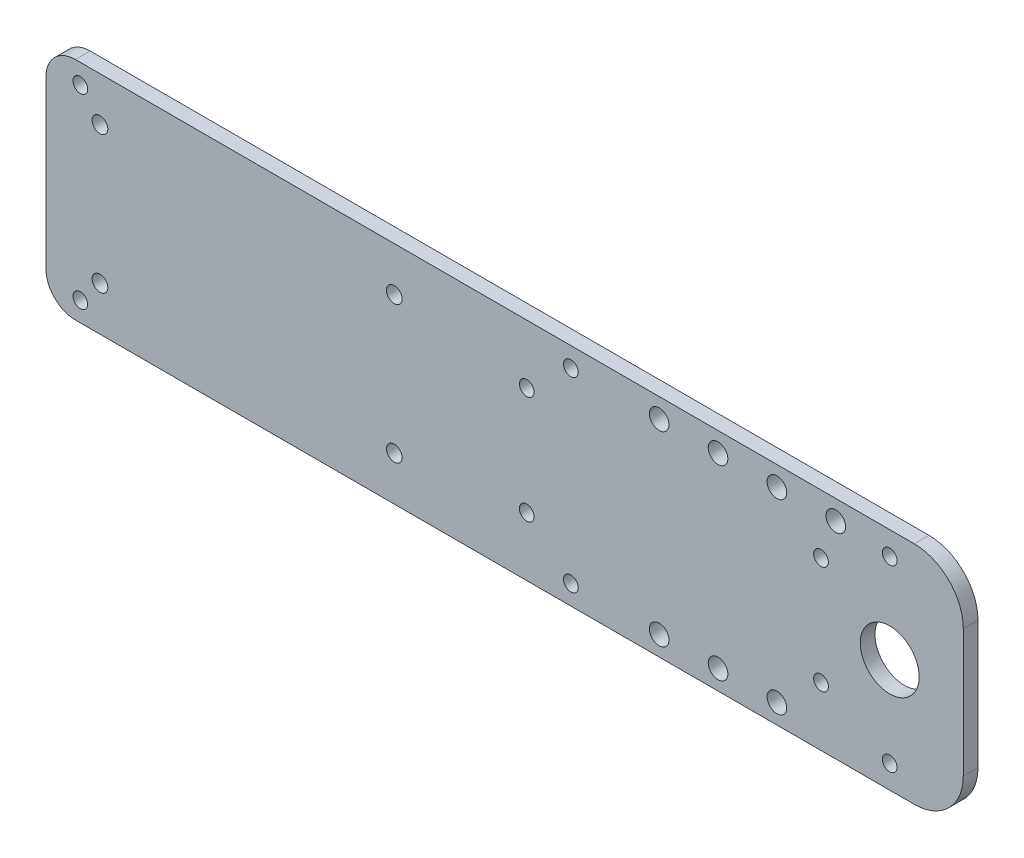
ISO-10303-21;
HEADER;
FILE_DESCRIPTION(('STEP AP214'),'2;1');
FILE_NAME('part.step','',(''),(''),'','','');
FILE_SCHEMA(('AUTOMOTIVE_DESIGN { 1 0 10303 214 1 1 1 1 }'));
ENDSEC;
DATA;
#1=APPLICATION_CONTEXT('core data for automotive mechanical design processes');
#2=APPLICATION_PROTOCOL_DEFINITION('international standard','automotive_design',2000,#1);
#3=PRODUCT_CONTEXT('',#1,'mechanical');
#4=PRODUCT('Part','Part','',(#3));
#5=PRODUCT_RELATED_PRODUCT_CATEGORY('part','',(#4));
#6=PRODUCT_DEFINITION_FORMATION('','',#4);
#7=PRODUCT_DEFINITION_CONTEXT('part definition',#1,'design');
#8=PRODUCT_DEFINITION('design','',#6,#7);
#9=PRODUCT_DEFINITION_SHAPE('','',#8);
#10=(LENGTH_UNIT() NAMED_UNIT(*) SI_UNIT(.MILLI.,.METRE.));
#11=(NAMED_UNIT(*) PLANE_ANGLE_UNIT() SI_UNIT($,.RADIAN.));
#12=(NAMED_UNIT(*) SI_UNIT($,.STERADIAN.) SOLID_ANGLE_UNIT());
#13=UNCERTAINTY_MEASURE_WITH_UNIT(LENGTH_MEASURE(1.E-05),#10,'distance_accuracy_value','');
#14=(GEOMETRIC_REPRESENTATION_CONTEXT(3) GLOBAL_UNCERTAINTY_ASSIGNED_CONTEXT((#13)) GLOBAL_UNIT_ASSIGNED_CONTEXT((#10,
#11,#12)) REPRESENTATION_CONTEXT('',''));
#15=CARTESIAN_POINT('',(0.,0.,0.));
#16=DIRECTION('',(0.,0.,1.));
#17=DIRECTION('',(1.,0.,0.));
#18=AXIS2_PLACEMENT_3D('',#15,#16,#17);
#19=CARTESIAN_POINT('',(0.,0.,3.));
#20=DIRECTION('',(0.,0.,1.));
#21=DIRECTION('',(1.,0.,0.));
#22=AXIS2_PLACEMENT_3D('',#19,#20,#21);
#23=PLANE('',#22);
#24=CARTESIAN_POINT('',(102.,11.,3.));
#25=DIRECTION('',(0.,0.,1.));
#26=DIRECTION('',(1.,0.,0.));
#27=AXIS2_PLACEMENT_3D('',#24,#25,#26);
#28=CIRCLE('',#27,1.5);
#29=CARTESIAN_POINT('',(103.5,11.,3.));
#30=VERTEX_POINT('',#29);
#31=EDGE_CURVE('E330',#30,#30,#28,.F.);
#32=ORIENTED_EDGE('',*,*,#31,.T.);
#33=EDGE_LOOP('',(#32));
#34=FACE_BOUND('',#33,.T.);
#35=CARTESIAN_POINT('',(69.,19.,3.));
#36=DIRECTION('',(0.,0.,1.));
#37=DIRECTION('',(1.,0.,0.));
#38=AXIS2_PLACEMENT_3D('',#35,#36,#37);
#39=CIRCLE('',#38,2.);
#40=CARTESIAN_POINT('',(71.,19.,3.));
#41=VERTEX_POINT('',#40);
#42=EDGE_CURVE('E342',#41,#41,#39,.T.);
#43=ORIENTED_EDGE('',*,*,#42,.F.);
#44=EDGE_LOOP('',(#43));
#45=FACE_BOUND('',#44,.T.);
#46=CARTESIAN_POINT('',(-49.,-19.,3.));
#47=DIRECTION('',(0.,0.,1.));
#48=DIRECTION('',(1.,0.,0.));
#49=AXIS2_PLACEMENT_3D('',#46,#47,#48);
#50=CIRCLE('',#49,1.5);
#51=CARTESIAN_POINT('',(-47.5,-19.,3.));
#52=VERTEX_POINT('',#51);
#53=EDGE_CURVE('E367',#52,#52,#50,.F.);
#54=ORIENTED_EDGE('',*,*,#53,.T.);
#55=EDGE_LOOP('',(#54));
#56=FACE_BOUND('',#55,.T.);
#57=CARTESIAN_POINT('',(69.,-19.,3.));
#58=DIRECTION('',(0.,0.,1.));
#59=DIRECTION('',(1.,0.,0.));
#60=AXIS2_PLACEMENT_3D('',#57,#58,#59);
#61=CIRCLE('',#60,2.);
#62=CARTESIAN_POINT('',(71.,-19.,3.));
#63=VERTEX_POINT('',#62);
#64=EDGE_CURVE('E343',#63,#63,#61,.T.);
#65=ORIENTED_EDGE('',*,*,#64,.F.);
#66=EDGE_LOOP('',(#65));
#67=FACE_BOUND('',#66,.T.);
#68=CARTESIAN_POINT('',(81.,-19.,3.));
#69=DIRECTION('',(0.,0.,1.));
#70=DIRECTION('',(1.,0.,0.));
#71=AXIS2_PLACEMENT_3D('',#68,#69,#70);
#72=CIRCLE('',#71,2.);
#73=CARTESIAN_POINT('',(83.,-19.,3.));
#74=VERTEX_POINT('',#73);
#75=EDGE_CURVE('E349',#74,#74,#72,.T.);
#76=ORIENTED_EDGE('',*,*,#75,.F.);
#77=EDGE_LOOP('',(#76));
#78=FACE_BOUND('',#77,.T.);
#79=CARTESIAN_POINT('',(81.,19.,3.));
#80=DIRECTION('',(0.,0.,1.));
#81=DIRECTION('',(1.,0.,0.));
#82=AXIS2_PLACEMENT_3D('',#79,#80,#81);
#83=CIRCLE('',#82,2.);
#84=CARTESIAN_POINT('',(83.,19.,3.));
#85=VERTEX_POINT('',#84);
#86=EDGE_CURVE('E329',#85,#85,#83,.T.);
#87=ORIENTED_EDGE('',*,*,#86,.F.);
#88=EDGE_LOOP('',(#87));
#89=FACE_BOUND('',#88,.T.);
#90=CARTESIAN_POINT('',(-49.,19.,3.));
#91=DIRECTION('',(0.,0.,1.));
#92=DIRECTION('',(1.,0.,0.));
#93=AXIS2_PLACEMENT_3D('',#90,#91,#92);
#94=CIRCLE('',#93,1.5);
#95=CARTESIAN_POINT('',(-47.5,19.,3.));
#96=VERTEX_POINT('',#95);
#97=EDGE_CURVE('E366',#96,#96,#94,.T.);
#98=ORIENTED_EDGE('',*,*,#97,.F.);
#99=EDGE_LOOP('',(#98));
#100=FACE_BOUND('',#99,.T.);
#101=DIRECTION('',(-1.,0.,0.));
#102=VECTOR('',#101,1.);
#103=CARTESIAN_POINT('',(0.,-23.,3.));
#104=LINE('',#103,#102);
#105=CARTESIAN_POINT('',(121.,-23.,3.));
#106=VERTEX_POINT('',#105);
#107=CARTESIAN_POINT('',(-50.,-23.,3.));
#108=VERTEX_POINT('',#107);
#109=EDGE_CURVE('E136',#106,#108,#104,.T.);
#110=ORIENTED_EDGE('',*,*,#109,.F.);
#111=CARTESIAN_POINT('',(121.,-13.,3.));
#112=DIRECTION('',(0.,0.,1.));
#113=DIRECTION('',(1.,0.,0.));
#114=AXIS2_PLACEMENT_3D('',#111,#112,#113);
#115=CIRCLE('',#114,10.);
#116=CARTESIAN_POINT('',(131.,-13.,3.));
#117=VERTEX_POINT('',#116);
#118=EDGE_CURVE('E163',#106,#117,#115,.T.);
#119=ORIENTED_EDGE('',*,*,#118,.T.);
#120=DIRECTION('',(0.,1.,0.));
#121=VECTOR('',#120,1.);
#122=CARTESIAN_POINT('',(131.,0.,3.));
#123=LINE('',#122,#121);
#124=CARTESIAN_POINT('',(131.,13.,3.));
#125=VERTEX_POINT('',#124);
#126=EDGE_CURVE('E177',#117,#125,#123,.T.);
#127=ORIENTED_EDGE('',*,*,#126,.T.);
#128=CARTESIAN_POINT('',(121.,13.,3.));
#129=DIRECTION('',(0.,0.,1.));
#130=DIRECTION('',(1.,0.,0.));
#131=AXIS2_PLACEMENT_3D('',#128,#129,#130);
#132=CIRCLE('',#131,10.);
#133=CARTESIAN_POINT('',(121.,23.,3.));
#134=VERTEX_POINT('',#133);
#135=EDGE_CURVE('E161',#125,#134,#132,.T.);
#136=ORIENTED_EDGE('',*,*,#135,.T.);
#137=DIRECTION('',(-1.,0.,0.));
#138=VECTOR('',#137,1.);
#139=CARTESIAN_POINT('',(0.,23.,3.));
#140=LINE('',#139,#138);
#141=CARTESIAN_POINT('',(-50.,23.,3.));
#142=VERTEX_POINT('',#141);
#143=EDGE_CURVE('E186',#134,#142,#140,.T.);
#144=ORIENTED_EDGE('',*,*,#143,.T.);
#145=CARTESIAN_POINT('',(-50.,17.,3.));
#146=DIRECTION('',(0.,0.,1.));
#147=DIRECTION('',(1.,0.,0.));
#148=AXIS2_PLACEMENT_3D('',#145,#146,#147);
#149=CIRCLE('',#148,6.);
#150=CARTESIAN_POINT('',(-56.,17.,3.));
#151=VERTEX_POINT('',#150);
#152=EDGE_CURVE('E152',#142,#151,#149,.T.);
#153=ORIENTED_EDGE('',*,*,#152,.T.);
#154=DIRECTION('',(0.,1.,0.));
#155=VECTOR('',#154,1.);
#156=CARTESIAN_POINT('',(-56.,0.,3.));
#157=LINE('',#156,#155);
#158=CARTESIAN_POINT('',(-56.,-17.,3.));
#159=VERTEX_POINT('',#158);
#160=EDGE_CURVE('E188',#159,#151,#157,.T.);
#161=ORIENTED_EDGE('',*,*,#160,.F.);
#162=CARTESIAN_POINT('',(-50.,-17.,3.));
#163=DIRECTION('',(0.,0.,1.));
#164=DIRECTION('',(1.,0.,0.));
#165=AXIS2_PLACEMENT_3D('',#162,#163,#164);
#166=CIRCLE('',#165,6.);
#167=EDGE_CURVE('E154',#159,#108,#166,.T.);
#168=ORIENTED_EDGE('',*,*,#167,.T.);
#169=EDGE_LOOP('',(#110,#119,#127,#136,#144,#153,#161,#168));
#170=FACE_BOUND('',#169,.T.);
#171=CARTESIAN_POINT('',(42.,11.,3.));
#172=DIRECTION('',(0.,0.,1.));
#173=DIRECTION('',(1.,0.,0.));
#174=AXIS2_PLACEMENT_3D('',#171,#172,#173);
#175=CIRCLE('',#174,1.50000000000001);
#176=CARTESIAN_POINT('',(43.5,11.,3.));
#177=VERTEX_POINT('',#176);
#178=EDGE_CURVE('E197',#177,#177,#175,.F.);
#179=ORIENTED_EDGE('',*,*,#178,.T.);
#180=EDGE_LOOP('',(#179));
#181=FACE_BOUND('',#180,.T.);
#182=CARTESIAN_POINT('',(15.,-14.,3.));
#183=DIRECTION('',(0.,0.,1.));
#184=DIRECTION('',(1.,0.,0.));
#185=AXIS2_PLACEMENT_3D('',#182,#183,#184);
#186=CIRCLE('',#185,1.6);
#187=CARTESIAN_POINT('',(16.6,-14.,3.));
#188=VERTEX_POINT('',#187);
#189=EDGE_CURVE('E200',#188,#188,#186,.T.);
#190=ORIENTED_EDGE('',*,*,#189,.F.);
#191=EDGE_LOOP('',(#190));
#192=FACE_BOUND('',#191,.T.);
#193=CARTESIAN_POINT('',(42.,-11.,3.));
#194=DIRECTION('',(0.,0.,1.));
#195=DIRECTION('',(1.,0.,0.));
#196=AXIS2_PLACEMENT_3D('',#193,#194,#195);
#197=CIRCLE('',#196,1.49999999999999);
#198=CARTESIAN_POINT('',(43.5,-11.,3.));
#199=VERTEX_POINT('',#198);
#200=EDGE_CURVE('E203',#199,#199,#197,.T.);
#201=ORIENTED_EDGE('',*,*,#200,.F.);
#202=EDGE_LOOP('',(#201));
#203=FACE_BOUND('',#202,.T.);
#204=CARTESIAN_POINT('',(-45.,14.,3.));
#205=DIRECTION('',(0.,0.,1.));
#206=DIRECTION('',(1.,0.,0.));
#207=AXIS2_PLACEMENT_3D('',#204,#205,#206);
#208=CIRCLE('',#207,1.6);
#209=CARTESIAN_POINT('',(-43.4,14.,3.));
#210=VERTEX_POINT('',#209);
#211=EDGE_CURVE('E206',#210,#210,#208,.T.);
#212=ORIENTED_EDGE('',*,*,#211,.F.);
#213=EDGE_LOOP('',(#212));
#214=FACE_BOUND('',#213,.T.);
#215=CARTESIAN_POINT('',(-45.,-14.,3.));
#216=DIRECTION('',(0.,0.,1.));
#217=DIRECTION('',(1.,0.,0.));
#218=AXIS2_PLACEMENT_3D('',#215,#216,#217);
#219=CIRCLE('',#218,1.6);
#220=CARTESIAN_POINT('',(-43.4,-14.,3.));
#221=VERTEX_POINT('',#220);
#222=EDGE_CURVE('E143',#221,#221,#219,.F.);
#223=ORIENTED_EDGE('',*,*,#222,.T.);
#224=EDGE_LOOP('',(#223));
#225=FACE_BOUND('',#224,.T.);
#226=CARTESIAN_POINT('',(15.,14.,3.));
#227=DIRECTION('',(0.,0.,1.));
#228=DIRECTION('',(1.,0.,0.));
#229=AXIS2_PLACEMENT_3D('',#226,#227,#228);
#230=CIRCLE('',#229,1.6);
#231=CARTESIAN_POINT('',(16.6,14.,3.));
#232=VERTEX_POINT('',#231);
#233=EDGE_CURVE('E138',#232,#232,#230,.F.);
#234=ORIENTED_EDGE('',*,*,#233,.T.);
#235=EDGE_LOOP('',(#234));
#236=FACE_BOUND('',#235,.T.);
#237=CARTESIAN_POINT('',(116.,-18.25,3.));
#238=DIRECTION('',(0.,0.,1.));
#239=DIRECTION('',(1.,0.,0.));
#240=AXIS2_PLACEMENT_3D('',#237,#238,#239);
#241=CIRCLE('',#240,1.5);
#242=CARTESIAN_POINT('',(117.5,-18.25,3.));
#243=VERTEX_POINT('',#242);
#244=EDGE_CURVE('E297',#243,#243,#241,.T.);
#245=ORIENTED_EDGE('',*,*,#244,.F.);
#246=EDGE_LOOP('',(#245));
#247=FACE_BOUND('',#246,.T.);
#248=CARTESIAN_POINT('',(116.,0.,3.));
#249=DIRECTION('',(0.,0.,1.));
#250=DIRECTION('',(1.,0.,0.));
#251=AXIS2_PLACEMENT_3D('',#248,#249,#250);
#252=CIRCLE('',#251,6.);
#253=CARTESIAN_POINT('',(122.,0.,3.));
#254=VERTEX_POINT('',#253);
#255=EDGE_CURVE('E301',#254,#254,#252,.T.);
#256=ORIENTED_EDGE('',*,*,#255,.F.);
#257=EDGE_LOOP('',(#256));
#258=FACE_BOUND('',#257,.T.);
#259=CARTESIAN_POINT('',(93.,-19.,3.));
#260=DIRECTION('',(0.,0.,1.));
#261=DIRECTION('',(1.,0.,0.));
#262=AXIS2_PLACEMENT_3D('',#259,#260,#261);
#263=CIRCLE('',#262,2.);
#264=CARTESIAN_POINT('',(95.,-19.,3.));
#265=VERTEX_POINT('',#264);
#266=EDGE_CURVE('E305',#265,#265,#263,.T.);
#267=ORIENTED_EDGE('',*,*,#266,.F.);
#268=EDGE_LOOP('',(#267));
#269=FACE_BOUND('',#268,.T.);
#270=CARTESIAN_POINT('',(105.,19.,3.));
#271=DIRECTION('',(0.,0.,1.));
#272=DIRECTION('',(1.,0.,0.));
#273=AXIS2_PLACEMENT_3D('',#270,#271,#272);
#274=CIRCLE('',#273,2.);
#275=CARTESIAN_POINT('',(107.,19.,3.));
#276=VERTEX_POINT('',#275);
#277=EDGE_CURVE('E309',#276,#276,#274,.T.);
#278=ORIENTED_EDGE('',*,*,#277,.F.);
#279=EDGE_LOOP('',(#278));
#280=FACE_BOUND('',#279,.T.);
#281=CARTESIAN_POINT('',(93.,19.,3.));
#282=DIRECTION('',(0.,0.,1.));
#283=DIRECTION('',(1.,0.,0.));
#284=AXIS2_PLACEMENT_3D('',#281,#282,#283);
#285=CIRCLE('',#284,2.);
#286=CARTESIAN_POINT('',(95.,19.,3.));
#287=VERTEX_POINT('',#286);
#288=EDGE_CURVE('E313',#287,#287,#285,.F.);
#289=ORIENTED_EDGE('',*,*,#288,.T.);
#290=EDGE_LOOP('',(#289));
#291=FACE_BOUND('',#290,.T.);
#292=CARTESIAN_POINT('',(116.,18.25,3.));
#293=DIRECTION('',(0.,0.,1.));
#294=DIRECTION('',(1.,0.,0.));
#295=AXIS2_PLACEMENT_3D('',#292,#293,#294);
#296=CIRCLE('',#295,1.50000000000001);
#297=CARTESIAN_POINT('',(117.5,18.25,3.));
#298=VERTEX_POINT('',#297);
#299=EDGE_CURVE('E180',#298,#298,#296,.F.);
#300=ORIENTED_EDGE('',*,*,#299,.T.);
#301=EDGE_LOOP('',(#300));
#302=FACE_BOUND('',#301,.T.);
#303=CARTESIAN_POINT('',(51.,19.,3.));
#304=DIRECTION('',(0.,0.,1.));
#305=DIRECTION('',(1.,0.,0.));
#306=AXIS2_PLACEMENT_3D('',#303,#304,#305);
#307=CIRCLE('',#306,1.5);
#308=CARTESIAN_POINT('',(52.5,19.,3.));
#309=VERTEX_POINT('',#308);
#310=EDGE_CURVE('E320',#309,#309,#307,.T.);
#311=ORIENTED_EDGE('',*,*,#310,.F.);
#312=EDGE_LOOP('',(#311));
#313=FACE_BOUND('',#312,.T.);
#314=CARTESIAN_POINT('',(51.,-19.,3.));
#315=DIRECTION('',(0.,0.,1.));
#316=DIRECTION('',(1.,0.,0.));
#317=AXIS2_PLACEMENT_3D('',#314,#315,#316);
#318=CIRCLE('',#317,1.5);
#319=CARTESIAN_POINT('',(52.5,-19.,3.));
#320=VERTEX_POINT('',#319);
#321=EDGE_CURVE('E324',#320,#320,#318,.F.);
#322=ORIENTED_EDGE('',*,*,#321,.T.);
#323=EDGE_LOOP('',(#322));
#324=FACE_BOUND('',#323,.T.);
#325=CARTESIAN_POINT('',(102.,-11.,3.));
#326=DIRECTION('',(0.,0.,1.));
#327=DIRECTION('',(1.,0.,0.));
#328=AXIS2_PLACEMENT_3D('',#325,#326,#327);
#329=CIRCLE('',#328,1.5);
#330=CARTESIAN_POINT('',(103.5,-11.,3.));
#331=VERTEX_POINT('',#330);
#332=EDGE_CURVE('E327',#331,#331,#329,.T.);
#333=ORIENTED_EDGE('',*,*,#332,.F.);
#334=EDGE_LOOP('',(#333));
#335=FACE_BOUND('',#334,.T.);
#336=ADVANCED_FACE('F46',(#34,#45,#56,#67,#78,#89,#100,#170,#181,#192,#203,#214,#225,#236,#247,
#258,#269,#280,#291,#302,#313,#324,#335),#23,.T.);
#337=CARTESIAN_POINT('',(0.,0.,0.));
#338=DIRECTION('',(0.,0.,1.));
#339=DIRECTION('',(1.,0.,0.));
#340=AXIS2_PLACEMENT_3D('',#337,#338,#339);
#341=PLANE('',#340);
#342=CARTESIAN_POINT('',(51.,-19.,0.));
#343=DIRECTION('',(0.,0.,1.));
#344=DIRECTION('',(1.,0.,0.));
#345=AXIS2_PLACEMENT_3D('',#342,#343,#344);
#346=CIRCLE('',#345,1.5);
#347=CARTESIAN_POINT('',(52.5,-19.,0.));
#348=VERTEX_POINT('',#347);
#349=EDGE_CURVE('E354',#348,#348,#346,.F.);
#350=ORIENTED_EDGE('',*,*,#349,.F.);
#351=EDGE_LOOP('',(#350));
#352=FACE_BOUND('',#351,.T.);
#353=CARTESIAN_POINT('',(-49.,-19.,0.));
#354=DIRECTION('',(0.,0.,1.));
#355=DIRECTION('',(1.,0.,0.));
#356=AXIS2_PLACEMENT_3D('',#353,#354,#355);
#357=CIRCLE('',#356,1.5);
#358=CARTESIAN_POINT('',(-47.5,-19.,0.));
#359=VERTEX_POINT('',#358);
#360=EDGE_CURVE('E363',#359,#359,#357,.F.);
#361=ORIENTED_EDGE('',*,*,#360,.F.);
#362=EDGE_LOOP('',(#361));
#363=FACE_BOUND('',#362,.T.);
#364=CARTESIAN_POINT('',(116.,18.25,0.));
#365=DIRECTION('',(0.,0.,1.));
#366=DIRECTION('',(1.,0.,0.));
#367=AXIS2_PLACEMENT_3D('',#364,#365,#366);
#368=CIRCLE('',#367,1.50000000000001);
#369=CARTESIAN_POINT('',(117.5,18.25,0.));
#370=VERTEX_POINT('',#369);
#371=EDGE_CURVE('E122',#370,#370,#368,.F.);
#372=ORIENTED_EDGE('',*,*,#371,.F.);
#373=EDGE_LOOP('',(#372));
#374=FACE_BOUND('',#373,.T.);
#375=CARTESIAN_POINT('',(93.,19.,0.));
#376=DIRECTION('',(0.,0.,1.));
#377=DIRECTION('',(1.,0.,0.));
#378=AXIS2_PLACEMENT_3D('',#375,#376,#377);
#379=CIRCLE('',#378,2.);
#380=CARTESIAN_POINT('',(95.,19.,0.));
#381=VERTEX_POINT('',#380);
#382=EDGE_CURVE('E390',#381,#381,#379,.F.);
#383=ORIENTED_EDGE('',*,*,#382,.F.);
#384=EDGE_LOOP('',(#383));
#385=FACE_BOUND('',#384,.T.);
#386=CARTESIAN_POINT('',(105.,19.,0.));
#387=DIRECTION('',(0.,0.,1.));
#388=DIRECTION('',(1.,0.,0.));
#389=AXIS2_PLACEMENT_3D('',#386,#387,#388);
#390=CIRCLE('',#389,2.);
#391=CARTESIAN_POINT('',(107.,19.,0.));
#392=VERTEX_POINT('',#391);
#393=EDGE_CURVE('E387',#392,#392,#390,.T.);
#394=ORIENTED_EDGE('',*,*,#393,.T.);
#395=EDGE_LOOP('',(#394));
#396=FACE_BOUND('',#395,.T.);
#397=CARTESIAN_POINT('',(93.,-19.,0.));
#398=DIRECTION('',(0.,0.,1.));
#399=DIRECTION('',(1.,0.,0.));
#400=AXIS2_PLACEMENT_3D('',#397,#398,#399);
#401=CIRCLE('',#400,2.);
#402=CARTESIAN_POINT('',(95.,-19.,0.));
#403=VERTEX_POINT('',#402);
#404=EDGE_CURVE('E384',#403,#403,#401,.T.);
#405=ORIENTED_EDGE('',*,*,#404,.T.);
#406=EDGE_LOOP('',(#405));
#407=FACE_BOUND('',#406,.T.);
#408=CARTESIAN_POINT('',(116.,0.,0.));
#409=DIRECTION('',(0.,0.,1.));
#410=DIRECTION('',(1.,0.,0.));
#411=AXIS2_PLACEMENT_3D('',#408,#409,#410);
#412=CIRCLE('',#411,6.);
#413=CARTESIAN_POINT('',(122.,0.,0.));
#414=VERTEX_POINT('',#413);
#415=EDGE_CURVE('E381',#414,#414,#412,.T.);
#416=ORIENTED_EDGE('',*,*,#415,.T.);
#417=EDGE_LOOP('',(#416));
#418=FACE_BOUND('',#417,.T.);
#419=CARTESIAN_POINT('',(116.,-18.25,0.));
#420=DIRECTION('',(0.,0.,1.));
#421=DIRECTION('',(1.,0.,0.));
#422=AXIS2_PLACEMENT_3D('',#419,#420,#421);
#423=CIRCLE('',#422,1.5);
#424=CARTESIAN_POINT('',(117.5,-18.25,0.));
#425=VERTEX_POINT('',#424);
#426=EDGE_CURVE('E179',#425,#425,#423,.T.);
#427=ORIENTED_EDGE('',*,*,#426,.T.);
#428=EDGE_LOOP('',(#427));
#429=FACE_BOUND('',#428,.T.);
#430=CARTESIAN_POINT('',(15.,14.,0.));
#431=DIRECTION('',(0.,0.,1.));
#432=DIRECTION('',(1.,0.,0.));
#433=AXIS2_PLACEMENT_3D('',#430,#431,#432);
#434=CIRCLE('',#433,1.6);
#435=CARTESIAN_POINT('',(16.6,14.,0.));
#436=VERTEX_POINT('',#435);
#437=EDGE_CURVE('E146',#436,#436,#434,.F.);
#438=ORIENTED_EDGE('',*,*,#437,.F.);
#439=EDGE_LOOP('',(#438));
#440=FACE_BOUND('',#439,.T.);
#441=CARTESIAN_POINT('',(-45.,-14.,0.));
#442=DIRECTION('',(0.,0.,1.));
#443=DIRECTION('',(1.,0.,0.));
#444=AXIS2_PLACEMENT_3D('',#441,#442,#443);
#445=CIRCLE('',#444,1.6);
#446=CARTESIAN_POINT('',(-43.4,-14.,0.));
#447=VERTEX_POINT('',#446);
#448=EDGE_CURVE('E191',#447,#447,#445,.F.);
#449=ORIENTED_EDGE('',*,*,#448,.F.);
#450=EDGE_LOOP('',(#449));
#451=FACE_BOUND('',#450,.T.);
#452=CARTESIAN_POINT('',(-45.,14.,0.));
#453=DIRECTION('',(0.,0.,1.));
#454=DIRECTION('',(1.,0.,0.));
#455=AXIS2_PLACEMENT_3D('',#452,#453,#454);
#456=CIRCLE('',#455,1.6);
#457=CARTESIAN_POINT('',(-43.4,14.,0.));
#458=VERTEX_POINT('',#457);
#459=EDGE_CURVE('E223',#458,#458,#456,.T.);
#460=ORIENTED_EDGE('',*,*,#459,.T.);
#461=EDGE_LOOP('',(#460));
#462=FACE_BOUND('',#461,.T.);
#463=CARTESIAN_POINT('',(42.,-11.,0.));
#464=DIRECTION('',(0.,0.,1.));
#465=DIRECTION('',(1.,0.,0.));
#466=AXIS2_PLACEMENT_3D('',#463,#464,#465);
#467=CIRCLE('',#466,1.49999999999999);
#468=CARTESIAN_POINT('',(43.5,-11.,0.));
#469=VERTEX_POINT('',#468);
#470=EDGE_CURVE('E220',#469,#469,#467,.T.);
#471=ORIENTED_EDGE('',*,*,#470,.T.);
#472=EDGE_LOOP('',(#471));
#473=FACE_BOUND('',#472,.T.);
#474=CARTESIAN_POINT('',(15.,-14.,0.));
#475=DIRECTION('',(0.,0.,1.));
#476=DIRECTION('',(1.,0.,0.));
#477=AXIS2_PLACEMENT_3D('',#474,#475,#476);
#478=CIRCLE('',#477,1.6);
#479=CARTESIAN_POINT('',(16.6,-14.,0.));
#480=VERTEX_POINT('',#479);
#481=EDGE_CURVE('E217',#480,#480,#478,.T.);
#482=ORIENTED_EDGE('',*,*,#481,.T.);
#483=EDGE_LOOP('',(#482));
#484=FACE_BOUND('',#483,.T.);
#485=CARTESIAN_POINT('',(42.,11.,0.));
#486=DIRECTION('',(0.,0.,1.));
#487=DIRECTION('',(1.,0.,0.));
#488=AXIS2_PLACEMENT_3D('',#485,#486,#487);
#489=CIRCLE('',#488,1.50000000000001);
#490=CARTESIAN_POINT('',(43.5,11.,0.));
#491=VERTEX_POINT('',#490);
#492=EDGE_CURVE('E214',#491,#491,#489,.F.);
#493=ORIENTED_EDGE('',*,*,#492,.F.);
#494=EDGE_LOOP('',(#493));
#495=FACE_BOUND('',#494,.T.);
#496=DIRECTION('',(0.,1.,0.));
#497=VECTOR('',#496,1.);
#498=CARTESIAN_POINT('',(131.,0.,0.));
#499=LINE('',#498,#497);
#500=CARTESIAN_POINT('',(131.,-13.,0.));
#501=VERTEX_POINT('',#500);
#502=CARTESIAN_POINT('',(131.,13.,0.));
#503=VERTEX_POINT('',#502);
#504=EDGE_CURVE('E174',#501,#503,#499,.T.);
#505=ORIENTED_EDGE('',*,*,#504,.F.);
#506=CARTESIAN_POINT('',(121.,-13.,0.));
#507=DIRECTION('',(0.,0.,1.));
#508=DIRECTION('',(1.,0.,0.));
#509=AXIS2_PLACEMENT_3D('',#506,#507,#508);
#510=CIRCLE('',#509,10.);
#511=CARTESIAN_POINT('',(121.,-23.,0.));
#512=VERTEX_POINT('',#511);
#513=EDGE_CURVE('E54',#501,#512,#510,.F.);
#514=ORIENTED_EDGE('',*,*,#513,.T.);
#515=DIRECTION('',(-1.,0.,0.));
#516=VECTOR('',#515,1.);
#517=CARTESIAN_POINT('',(0.,-23.,0.));
#518=LINE('',#517,#516);
#519=CARTESIAN_POINT('',(-50.,-23.,0.));
#520=VERTEX_POINT('',#519);
#521=EDGE_CURVE('E109',#512,#520,#518,.T.);
#522=ORIENTED_EDGE('',*,*,#521,.T.);
#523=CARTESIAN_POINT('',(-50.,-17.,0.));
#524=DIRECTION('',(0.,0.,1.));
#525=DIRECTION('',(1.,0.,0.));
#526=AXIS2_PLACEMENT_3D('',#523,#524,#525);
#527=CIRCLE('',#526,6.);
#528=CARTESIAN_POINT('',(-56.,-17.,0.));
#529=VERTEX_POINT('',#528);
#530=EDGE_CURVE('E114',#520,#529,#527,.F.);
#531=ORIENTED_EDGE('',*,*,#530,.T.);
#532=DIRECTION('',(0.,1.,0.));
#533=VECTOR('',#532,1.);
#534=CARTESIAN_POINT('',(-56.,0.,0.));
#535=LINE('',#534,#533);
#536=CARTESIAN_POINT('',(-56.,17.,0.));
#537=VERTEX_POINT('',#536);
#538=EDGE_CURVE('E212',#529,#537,#535,.T.);
#539=ORIENTED_EDGE('',*,*,#538,.T.);
#540=CARTESIAN_POINT('',(-50.,17.,0.));
#541=DIRECTION('',(0.,0.,1.));
#542=DIRECTION('',(1.,0.,0.));
#543=AXIS2_PLACEMENT_3D('',#540,#541,#542);
#544=CIRCLE('',#543,6.);
#545=CARTESIAN_POINT('',(-50.,23.,0.));
#546=VERTEX_POINT('',#545);
#547=EDGE_CURVE('E132',#537,#546,#544,.F.);
#548=ORIENTED_EDGE('',*,*,#547,.T.);
#549=DIRECTION('',(-1.,0.,0.));
#550=VECTOR('',#549,1.);
#551=CARTESIAN_POINT('',(0.,23.,0.));
#552=LINE('',#551,#550);
#553=CARTESIAN_POINT('',(121.,23.,0.));
#554=VERTEX_POINT('',#553);
#555=EDGE_CURVE('E121',#554,#546,#552,.T.);
#556=ORIENTED_EDGE('',*,*,#555,.F.);
#557=CARTESIAN_POINT('',(121.,13.,0.));
#558=DIRECTION('',(0.,0.,1.));
#559=DIRECTION('',(1.,0.,0.));
#560=AXIS2_PLACEMENT_3D('',#557,#558,#559);
#561=CIRCLE('',#560,10.);
#562=EDGE_CURVE('E66',#554,#503,#561,.F.);
#563=ORIENTED_EDGE('',*,*,#562,.T.);
#564=EDGE_LOOP('',(#505,#514,#522,#531,#539,#548,#556,#563));
#565=FACE_BOUND('',#564,.T.);
#566=CARTESIAN_POINT('',(-49.,19.,0.));
#567=DIRECTION('',(0.,0.,1.));
#568=DIRECTION('',(1.,0.,0.));
#569=AXIS2_PLACEMENT_3D('',#566,#567,#568);
#570=CIRCLE('',#569,1.5);
#571=CARTESIAN_POINT('',(-47.5,19.,0.));
#572=VERTEX_POINT('',#571);
#573=EDGE_CURVE('E374',#572,#572,#570,.T.);
#574=ORIENTED_EDGE('',*,*,#573,.T.);
#575=EDGE_LOOP('',(#574));
#576=FACE_BOUND('',#575,.T.);
#577=CARTESIAN_POINT('',(81.,19.,0.));
#578=DIRECTION('',(0.,0.,1.));
#579=DIRECTION('',(1.,0.,0.));
#580=AXIS2_PLACEMENT_3D('',#577,#578,#579);
#581=CIRCLE('',#580,2.);
#582=CARTESIAN_POINT('',(83.,19.,0.));
#583=VERTEX_POINT('',#582);
#584=EDGE_CURVE('E333',#583,#583,#581,.T.);
#585=ORIENTED_EDGE('',*,*,#584,.T.);
#586=EDGE_LOOP('',(#585));
#587=FACE_BOUND('',#586,.T.);
#588=CARTESIAN_POINT('',(81.,-19.,0.));
#589=DIRECTION('',(0.,0.,1.));
#590=DIRECTION('',(1.,0.,0.));
#591=AXIS2_PLACEMENT_3D('',#588,#589,#590);
#592=CIRCLE('',#591,2.);
#593=CARTESIAN_POINT('',(83.,-19.,0.));
#594=VERTEX_POINT('',#593);
#595=EDGE_CURVE('E346',#594,#594,#592,.T.);
#596=ORIENTED_EDGE('',*,*,#595,.T.);
#597=EDGE_LOOP('',(#596));
#598=FACE_BOUND('',#597,.T.);
#599=CARTESIAN_POINT('',(69.,-19.,0.));
#600=DIRECTION('',(0.,0.,1.));
#601=DIRECTION('',(1.,0.,0.));
#602=AXIS2_PLACEMENT_3D('',#599,#600,#601);
#603=CIRCLE('',#602,2.);
#604=CARTESIAN_POINT('',(71.,-19.,0.));
#605=VERTEX_POINT('',#604);
#606=EDGE_CURVE('E339',#605,#605,#603,.T.);
#607=ORIENTED_EDGE('',*,*,#606,.T.);
#608=EDGE_LOOP('',(#607));
#609=FACE_BOUND('',#608,.T.);
#610=CARTESIAN_POINT('',(51.,19.,0.));
#611=DIRECTION('',(0.,0.,1.));
#612=DIRECTION('',(1.,0.,0.));
#613=AXIS2_PLACEMENT_3D('',#610,#611,#612);
#614=CIRCLE('',#613,1.5);
#615=CARTESIAN_POINT('',(52.5,19.,0.));
#616=VERTEX_POINT('',#615);
#617=EDGE_CURVE('E370',#616,#616,#614,.T.);
#618=ORIENTED_EDGE('',*,*,#617,.T.);
#619=EDGE_LOOP('',(#618));
#620=FACE_BOUND('',#619,.T.);
#621=CARTESIAN_POINT('',(69.,19.,0.));
#622=DIRECTION('',(0.,0.,1.));
#623=DIRECTION('',(1.,0.,0.));
#624=AXIS2_PLACEMENT_3D('',#621,#622,#623);
#625=CIRCLE('',#624,2.);
#626=CARTESIAN_POINT('',(71.,19.,0.));
#627=VERTEX_POINT('',#626);
#628=EDGE_CURVE('E358',#627,#627,#625,.T.);
#629=ORIENTED_EDGE('',*,*,#628,.T.);
#630=EDGE_LOOP('',(#629));
#631=FACE_BOUND('',#630,.T.);
#632=CARTESIAN_POINT('',(102.,11.,0.));
#633=DIRECTION('',(0.,0.,1.));
#634=DIRECTION('',(1.,0.,0.));
#635=AXIS2_PLACEMENT_3D('',#632,#633,#634);
#636=CIRCLE('',#635,1.5);
#637=CARTESIAN_POINT('',(103.5,11.,0.));
#638=VERTEX_POINT('',#637);
#639=EDGE_CURVE('E482',#638,#638,#636,.T.);
#640=ORIENTED_EDGE('',*,*,#639,.T.);
#641=EDGE_LOOP('',(#640));
#642=FACE_BOUND('',#641,.T.);
#643=CARTESIAN_POINT('',(102.,-11.,0.));
#644=DIRECTION('',(0.,0.,-1.));
#645=DIRECTION('',(-1.,0.,0.));
#646=AXIS2_PLACEMENT_3D('',#643,#644,#645);
#647=CIRCLE('',#646,1.5);
#648=CARTESIAN_POINT('',(100.5,-11.,0.));
#649=VERTEX_POINT('',#648);
#650=EDGE_CURVE('E335',#649,#649,#647,.T.);
#651=ORIENTED_EDGE('',*,*,#650,.F.);
#652=EDGE_LOOP('',(#651));
#653=FACE_BOUND('',#652,.T.);
#654=ADVANCED_FACE('F111',(#352,#363,#374,#385,#396,#407,#418,#429,#440,#451,#462,#473,#484,
#495,#565,#576,#587,#598,#609,#620,#631,#642,#653),#341,.F.);
#655=CARTESIAN_POINT('',(0.,-23.,3.));
#656=DIRECTION('',(0.,-1.,0.));
#657=DIRECTION('',(1.,0.,0.));
#658=AXIS2_PLACEMENT_3D('',#655,#656,#657);
#659=PLANE('',#658);
#660=ORIENTED_EDGE('',*,*,#521,.F.);
#661=DIRECTION('',(0.,0.,1.));
#662=VECTOR('',#661,1.);
#663=CARTESIAN_POINT('',(121.,-23.,3.));
#664=LINE('',#663,#662);
#665=EDGE_CURVE('E159',#512,#106,#664,.T.);
#666=ORIENTED_EDGE('',*,*,#665,.T.);
#667=ORIENTED_EDGE('',*,*,#109,.T.);
#668=DIRECTION('',(0.,0.,-1.));
#669=VECTOR('',#668,1.);
#670=CARTESIAN_POINT('',(-50.,-23.,3.));
#671=LINE('',#670,#669);
#672=EDGE_CURVE('E129',#108,#520,#671,.T.);
#673=ORIENTED_EDGE('',*,*,#672,.T.);
#674=EDGE_LOOP('',(#660,#666,#667,#673));
#675=FACE_BOUND('',#674,.T.);
#676=ADVANCED_FACE('F134',(#675),#659,.T.);
#677=CARTESIAN_POINT('',(0.,23.,3.));
#678=DIRECTION('',(0.,-1.,0.));
#679=DIRECTION('',(1.,0.,0.));
#680=AXIS2_PLACEMENT_3D('',#677,#678,#679);
#681=PLANE('',#680);
#682=ORIENTED_EDGE('',*,*,#143,.F.);
#683=DIRECTION('',(0.,0.,1.));
#684=VECTOR('',#683,1.);
#685=CARTESIAN_POINT('',(121.,23.,0.));
#686=LINE('',#685,#684);
#687=EDGE_CURVE('E13',#134,#554,#686,.F.);
#688=ORIENTED_EDGE('',*,*,#687,.T.);
#689=ORIENTED_EDGE('',*,*,#555,.T.);
#690=DIRECTION('',(0.,0.,-1.));
#691=VECTOR('',#690,1.);
#692=CARTESIAN_POINT('',(-50.,23.,3.));
#693=LINE('',#692,#691);
#694=EDGE_CURVE('E156',#546,#142,#693,.F.);
#695=ORIENTED_EDGE('',*,*,#694,.T.);
#696=EDGE_LOOP('',(#682,#688,#689,#695));
#697=FACE_BOUND('',#696,.T.);
#698=ADVANCED_FACE('F275',(#697),#681,.F.);
#699=CARTESIAN_POINT('',(-45.,-14.,3.));
#700=DIRECTION('',(0.,0.,-1.));
#701=DIRECTION('',(-1.,0.,0.));
#702=AXIS2_PLACEMENT_3D('',#699,#700,#701);
#703=CYLINDRICAL_SURFACE('',#702,1.6);
#704=ORIENTED_EDGE('',*,*,#222,.F.);
#705=EDGE_LOOP('',(#704));
#706=FACE_BOUND('',#705,.T.);
#707=ORIENTED_EDGE('',*,*,#448,.T.);
#708=EDGE_LOOP('',(#707));
#709=FACE_BOUND('',#708,.T.);
#710=ADVANCED_FACE('F228',(#706,#709),#703,.F.);
#711=CARTESIAN_POINT('',(-45.,14.,3.));
#712=DIRECTION('',(0.,0.,-1.));
#713=DIRECTION('',(-1.,0.,0.));
#714=AXIS2_PLACEMENT_3D('',#711,#712,#713);
#715=CYLINDRICAL_SURFACE('',#714,1.6);
#716=ORIENTED_EDGE('',*,*,#211,.T.);
#717=EDGE_LOOP('',(#716));
#718=FACE_BOUND('',#717,.T.);
#719=ORIENTED_EDGE('',*,*,#459,.F.);
#720=EDGE_LOOP('',(#719));
#721=FACE_BOUND('',#720,.T.);
#722=ADVANCED_FACE('F274',(#718,#721),#715,.F.);
#723=CARTESIAN_POINT('',(42.,-11.,3.));
#724=DIRECTION('',(0.,0.,-1.));
#725=DIRECTION('',(-1.,0.,0.));
#726=AXIS2_PLACEMENT_3D('',#723,#724,#725);
#727=CYLINDRICAL_SURFACE('',#726,1.49999999999999);
#728=ORIENTED_EDGE('',*,*,#200,.T.);
#729=EDGE_LOOP('',(#728));
#730=FACE_BOUND('',#729,.T.);
#731=ORIENTED_EDGE('',*,*,#470,.F.);
#732=EDGE_LOOP('',(#731));
#733=FACE_BOUND('',#732,.T.);
#734=ADVANCED_FACE('F255',(#730,#733),#727,.F.);
#735=CARTESIAN_POINT('',(15.,-14.,3.));
#736=DIRECTION('',(0.,0.,-1.));
#737=DIRECTION('',(-1.,0.,0.));
#738=AXIS2_PLACEMENT_3D('',#735,#736,#737);
#739=CYLINDRICAL_SURFACE('',#738,1.6);
#740=ORIENTED_EDGE('',*,*,#189,.T.);
#741=EDGE_LOOP('',(#740));
#742=FACE_BOUND('',#741,.T.);
#743=ORIENTED_EDGE('',*,*,#481,.F.);
#744=EDGE_LOOP('',(#743));
#745=FACE_BOUND('',#744,.T.);
#746=ADVANCED_FACE('F245',(#742,#745),#739,.F.);
#747=CARTESIAN_POINT('',(42.,11.,3.));
#748=DIRECTION('',(0.,0.,-1.));
#749=DIRECTION('',(-1.,0.,0.));
#750=AXIS2_PLACEMENT_3D('',#747,#748,#749);
#751=CYLINDRICAL_SURFACE('',#750,1.50000000000001);
#752=ORIENTED_EDGE('',*,*,#178,.F.);
#753=EDGE_LOOP('',(#752));
#754=FACE_BOUND('',#753,.T.);
#755=ORIENTED_EDGE('',*,*,#492,.T.);
#756=EDGE_LOOP('',(#755));
#757=FACE_BOUND('',#756,.T.);
#758=ADVANCED_FACE('F242',(#754,#757),#751,.F.);
#759=CARTESIAN_POINT('',(-56.,0.,3.));
#760=DIRECTION('',(-1.,0.,0.));
#761=DIRECTION('',(0.,-1.,0.));
#762=AXIS2_PLACEMENT_3D('',#759,#760,#761);
#763=PLANE('',#762);
#764=ORIENTED_EDGE('',*,*,#538,.F.);
#765=DIRECTION('',(0.,0.,-1.));
#766=VECTOR('',#765,1.);
#767=CARTESIAN_POINT('',(-56.,-17.,3.));
#768=LINE('',#767,#766);
#769=EDGE_CURVE('E130',#529,#159,#768,.F.);
#770=ORIENTED_EDGE('',*,*,#769,.T.);
#771=ORIENTED_EDGE('',*,*,#160,.T.);
#772=DIRECTION('',(0.,0.,-1.));
#773=VECTOR('',#772,1.);
#774=CARTESIAN_POINT('',(-56.,17.,0.));
#775=LINE('',#774,#773);
#776=EDGE_CURVE('E131',#151,#537,#775,.T.);
#777=ORIENTED_EDGE('',*,*,#776,.T.);
#778=EDGE_LOOP('',(#764,#770,#771,#777));
#779=FACE_BOUND('',#778,.T.);
#780=ADVANCED_FACE('F244',(#779),#763,.T.);
#781=CARTESIAN_POINT('',(15.,14.,3.));
#782=DIRECTION('',(0.,0.,-1.));
#783=DIRECTION('',(-1.,0.,0.));
#784=AXIS2_PLACEMENT_3D('',#781,#782,#783);
#785=CYLINDRICAL_SURFACE('',#784,1.6);
#786=ORIENTED_EDGE('',*,*,#233,.F.);
#787=EDGE_LOOP('',(#786));
#788=FACE_BOUND('',#787,.T.);
#789=ORIENTED_EDGE('',*,*,#437,.T.);
#790=EDGE_LOOP('',(#789));
#791=FACE_BOUND('',#790,.T.);
#792=ADVANCED_FACE('F252',(#788,#791),#785,.F.);
#793=CARTESIAN_POINT('',(-50.,-17.,3.));
#794=DIRECTION('',(0.,0.,-1.));
#795=DIRECTION('',(-1.,0.,0.));
#796=AXIS2_PLACEMENT_3D('',#793,#794,#795);
#797=CYLINDRICAL_SURFACE('',#796,6.);
#798=ORIENTED_EDGE('',*,*,#167,.F.);
#799=ORIENTED_EDGE('',*,*,#769,.F.);
#800=ORIENTED_EDGE('',*,*,#530,.F.);
#801=ORIENTED_EDGE('',*,*,#672,.F.);
#802=EDGE_LOOP('',(#798,#799,#800,#801));
#803=FACE_BOUND('',#802,.T.);
#804=ADVANCED_FACE('F128',(#803),#797,.T.);
#805=CARTESIAN_POINT('',(-50.,17.,3.));
#806=DIRECTION('',(0.,0.,1.));
#807=DIRECTION('',(1.,0.,0.));
#808=AXIS2_PLACEMENT_3D('',#805,#806,#807);
#809=CYLINDRICAL_SURFACE('',#808,6.);
#810=ORIENTED_EDGE('',*,*,#152,.F.);
#811=ORIENTED_EDGE('',*,*,#694,.F.);
#812=ORIENTED_EDGE('',*,*,#547,.F.);
#813=ORIENTED_EDGE('',*,*,#776,.F.);
#814=EDGE_LOOP('',(#810,#811,#812,#813));
#815=FACE_BOUND('',#814,.T.);
#816=ADVANCED_FACE('F575',(#815),#809,.T.);
#817=CARTESIAN_POINT('',(131.,0.,0.));
#818=DIRECTION('',(1.,0.,0.));
#819=DIRECTION('',(0.,0.,-1.));
#820=AXIS2_PLACEMENT_3D('',#817,#818,#819);
#821=PLANE('',#820);
#822=ORIENTED_EDGE('',*,*,#126,.F.);
#823=DIRECTION('',(0.,0.,1.));
#824=VECTOR('',#823,1.);
#825=CARTESIAN_POINT('',(131.,-13.,0.));
#826=LINE('',#825,#824);
#827=EDGE_CURVE('E168',#117,#501,#826,.F.);
#828=ORIENTED_EDGE('',*,*,#827,.T.);
#829=ORIENTED_EDGE('',*,*,#504,.T.);
#830=DIRECTION('',(0.,0.,1.));
#831=VECTOR('',#830,1.);
#832=CARTESIAN_POINT('',(131.,13.,3.));
#833=LINE('',#832,#831);
#834=EDGE_CURVE('E165',#503,#125,#833,.T.);
#835=ORIENTED_EDGE('',*,*,#834,.T.);
#836=EDGE_LOOP('',(#822,#828,#829,#835));
#837=FACE_BOUND('',#836,.T.);
#838=ADVANCED_FACE('F173',(#837),#821,.T.);
#839=CARTESIAN_POINT('',(93.,19.,0.));
#840=DIRECTION('',(0.,0.,1.));
#841=DIRECTION('',(1.,0.,0.));
#842=AXIS2_PLACEMENT_3D('',#839,#840,#841);
#843=CYLINDRICAL_SURFACE('',#842,2.);
#844=ORIENTED_EDGE('',*,*,#382,.T.);
#845=EDGE_LOOP('',(#844));
#846=FACE_BOUND('',#845,.T.);
#847=ORIENTED_EDGE('',*,*,#288,.F.);
#848=EDGE_LOOP('',(#847));
#849=FACE_BOUND('',#848,.T.);
#850=ADVANCED_FACE('F403',(#846,#849),#843,.F.);
#851=CARTESIAN_POINT('',(105.,19.,0.));
#852=DIRECTION('',(0.,0.,1.));
#853=DIRECTION('',(1.,0.,0.));
#854=AXIS2_PLACEMENT_3D('',#851,#852,#853);
#855=CYLINDRICAL_SURFACE('',#854,2.);
#856=ORIENTED_EDGE('',*,*,#393,.F.);
#857=EDGE_LOOP('',(#856));
#858=FACE_BOUND('',#857,.T.);
#859=ORIENTED_EDGE('',*,*,#277,.T.);
#860=EDGE_LOOP('',(#859));
#861=FACE_BOUND('',#860,.T.);
#862=ADVANCED_FACE('F400',(#858,#861),#855,.F.);
#863=CARTESIAN_POINT('',(93.,-19.,0.));
#864=DIRECTION('',(0.,0.,1.));
#865=DIRECTION('',(1.,0.,0.));
#866=AXIS2_PLACEMENT_3D('',#863,#864,#865);
#867=CYLINDRICAL_SURFACE('',#866,2.);
#868=ORIENTED_EDGE('',*,*,#404,.F.);
#869=EDGE_LOOP('',(#868));
#870=FACE_BOUND('',#869,.T.);
#871=ORIENTED_EDGE('',*,*,#266,.T.);
#872=EDGE_LOOP('',(#871));
#873=FACE_BOUND('',#872,.T.);
#874=ADVANCED_FACE('F402',(#870,#873),#867,.F.);
#875=CARTESIAN_POINT('',(116.,0.,0.));
#876=DIRECTION('',(0.,0.,1.));
#877=DIRECTION('',(1.,0.,0.));
#878=AXIS2_PLACEMENT_3D('',#875,#876,#877);
#879=CYLINDRICAL_SURFACE('',#878,6.);
#880=ORIENTED_EDGE('',*,*,#415,.F.);
#881=EDGE_LOOP('',(#880));
#882=FACE_BOUND('',#881,.T.);
#883=ORIENTED_EDGE('',*,*,#255,.T.);
#884=EDGE_LOOP('',(#883));
#885=FACE_BOUND('',#884,.T.);
#886=ADVANCED_FACE('F410',(#882,#885),#879,.F.);
#887=CARTESIAN_POINT('',(116.,-18.25,0.));
#888=DIRECTION('',(0.,0.,1.));
#889=DIRECTION('',(1.,0.,0.));
#890=AXIS2_PLACEMENT_3D('',#887,#888,#889);
#891=CYLINDRICAL_SURFACE('',#890,1.5);
#892=ORIENTED_EDGE('',*,*,#426,.F.);
#893=EDGE_LOOP('',(#892));
#894=FACE_BOUND('',#893,.T.);
#895=ORIENTED_EDGE('',*,*,#244,.T.);
#896=EDGE_LOOP('',(#895));
#897=FACE_BOUND('',#896,.T.);
#898=ADVANCED_FACE('F419',(#894,#897),#891,.F.);
#899=CARTESIAN_POINT('',(116.,18.25,0.));
#900=DIRECTION('',(0.,0.,1.));
#901=DIRECTION('',(1.,0.,0.));
#902=AXIS2_PLACEMENT_3D('',#899,#900,#901);
#903=CYLINDRICAL_SURFACE('',#902,1.50000000000001);
#904=ORIENTED_EDGE('',*,*,#371,.T.);
#905=EDGE_LOOP('',(#904));
#906=FACE_BOUND('',#905,.T.);
#907=ORIENTED_EDGE('',*,*,#299,.F.);
#908=EDGE_LOOP('',(#907));
#909=FACE_BOUND('',#908,.T.);
#910=ADVANCED_FACE('F422',(#906,#909),#903,.F.);
#911=CARTESIAN_POINT('',(-49.,19.,0.));
#912=DIRECTION('',(0.,0.,1.));
#913=DIRECTION('',(1.,0.,0.));
#914=AXIS2_PLACEMENT_3D('',#911,#912,#913);
#915=CYLINDRICAL_SURFACE('',#914,1.5);
#916=ORIENTED_EDGE('',*,*,#573,.F.);
#917=EDGE_LOOP('',(#916));
#918=FACE_BOUND('',#917,.T.);
#919=ORIENTED_EDGE('',*,*,#97,.T.);
#920=EDGE_LOOP('',(#919));
#921=FACE_BOUND('',#920,.T.);
#922=ADVANCED_FACE('F427',(#918,#921),#915,.F.);
#923=CARTESIAN_POINT('',(81.,19.,0.));
#924=DIRECTION('',(0.,0.,1.));
#925=DIRECTION('',(1.,0.,0.));
#926=AXIS2_PLACEMENT_3D('',#923,#924,#925);
#927=CYLINDRICAL_SURFACE('',#926,2.);
#928=ORIENTED_EDGE('',*,*,#584,.F.);
#929=EDGE_LOOP('',(#928));
#930=FACE_BOUND('',#929,.T.);
#931=ORIENTED_EDGE('',*,*,#86,.T.);
#932=EDGE_LOOP('',(#931));
#933=FACE_BOUND('',#932,.T.);
#934=ADVANCED_FACE('F438',(#930,#933),#927,.F.);
#935=CARTESIAN_POINT('',(81.,-19.,0.));
#936=DIRECTION('',(0.,0.,1.));
#937=DIRECTION('',(1.,0.,0.));
#938=AXIS2_PLACEMENT_3D('',#935,#936,#937);
#939=CYLINDRICAL_SURFACE('',#938,2.);
#940=ORIENTED_EDGE('',*,*,#595,.F.);
#941=EDGE_LOOP('',(#940));
#942=FACE_BOUND('',#941,.T.);
#943=ORIENTED_EDGE('',*,*,#75,.T.);
#944=EDGE_LOOP('',(#943));
#945=FACE_BOUND('',#944,.T.);
#946=ADVANCED_FACE('F462',(#942,#945),#939,.F.);
#947=CARTESIAN_POINT('',(69.,-19.,0.));
#948=DIRECTION('',(0.,0.,1.));
#949=DIRECTION('',(1.,0.,0.));
#950=AXIS2_PLACEMENT_3D('',#947,#948,#949);
#951=CYLINDRICAL_SURFACE('',#950,2.);
#952=ORIENTED_EDGE('',*,*,#606,.F.);
#953=EDGE_LOOP('',(#952));
#954=FACE_BOUND('',#953,.T.);
#955=ORIENTED_EDGE('',*,*,#64,.T.);
#956=EDGE_LOOP('',(#955));
#957=FACE_BOUND('',#956,.T.);
#958=ADVANCED_FACE('F451',(#954,#957),#951,.F.);
#959=CARTESIAN_POINT('',(-49.,-19.,0.));
#960=DIRECTION('',(0.,0.,1.));
#961=DIRECTION('',(1.,0.,0.));
#962=AXIS2_PLACEMENT_3D('',#959,#960,#961);
#963=CYLINDRICAL_SURFACE('',#962,1.5);
#964=ORIENTED_EDGE('',*,*,#360,.T.);
#965=EDGE_LOOP('',(#964));
#966=FACE_BOUND('',#965,.T.);
#967=ORIENTED_EDGE('',*,*,#53,.F.);
#968=EDGE_LOOP('',(#967));
#969=FACE_BOUND('',#968,.T.);
#970=ADVANCED_FACE('F447',(#966,#969),#963,.F.);
#971=CARTESIAN_POINT('',(51.,19.,0.));
#972=DIRECTION('',(0.,0.,1.));
#973=DIRECTION('',(1.,0.,0.));
#974=AXIS2_PLACEMENT_3D('',#971,#972,#973);
#975=CYLINDRICAL_SURFACE('',#974,1.5);
#976=ORIENTED_EDGE('',*,*,#617,.F.);
#977=EDGE_LOOP('',(#976));
#978=FACE_BOUND('',#977,.T.);
#979=ORIENTED_EDGE('',*,*,#310,.T.);
#980=EDGE_LOOP('',(#979));
#981=FACE_BOUND('',#980,.T.);
#982=ADVANCED_FACE('F443',(#978,#981),#975,.F.);
#983=CARTESIAN_POINT('',(51.,-19.,0.));
#984=DIRECTION('',(0.,0.,1.));
#985=DIRECTION('',(1.,0.,0.));
#986=AXIS2_PLACEMENT_3D('',#983,#984,#985);
#987=CYLINDRICAL_SURFACE('',#986,1.5);
#988=ORIENTED_EDGE('',*,*,#349,.T.);
#989=EDGE_LOOP('',(#988));
#990=FACE_BOUND('',#989,.T.);
#991=ORIENTED_EDGE('',*,*,#321,.F.);
#992=EDGE_LOOP('',(#991));
#993=FACE_BOUND('',#992,.T.);
#994=ADVANCED_FACE('F446',(#990,#993),#987,.F.);
#995=CARTESIAN_POINT('',(69.,19.,0.));
#996=DIRECTION('',(0.,0.,1.));
#997=DIRECTION('',(1.,0.,0.));
#998=AXIS2_PLACEMENT_3D('',#995,#996,#997);
#999=CYLINDRICAL_SURFACE('',#998,2.);
#1000=ORIENTED_EDGE('',*,*,#628,.F.);
#1001=EDGE_LOOP('',(#1000));
#1002=FACE_BOUND('',#1001,.T.);
#1003=ORIENTED_EDGE('',*,*,#42,.T.);
#1004=EDGE_LOOP('',(#1003));
#1005=FACE_BOUND('',#1004,.T.);
#1006=ADVANCED_FACE('F453',(#1002,#1005),#999,.F.);
#1007=CARTESIAN_POINT('',(121.,-13.,3.));
#1008=DIRECTION('',(0.,0.,1.));
#1009=DIRECTION('',(1.,0.,0.));
#1010=AXIS2_PLACEMENT_3D('',#1007,#1008,#1009);
#1011=CYLINDRICAL_SURFACE('',#1010,10.);
#1012=ORIENTED_EDGE('',*,*,#513,.F.);
#1013=ORIENTED_EDGE('',*,*,#827,.F.);
#1014=ORIENTED_EDGE('',*,*,#118,.F.);
#1015=ORIENTED_EDGE('',*,*,#665,.F.);
#1016=EDGE_LOOP('',(#1012,#1013,#1014,#1015));
#1017=FACE_BOUND('',#1016,.T.);
#1018=ADVANCED_FACE('F182',(#1017),#1011,.T.);
#1019=CARTESIAN_POINT('',(121.,13.,0.));
#1020=DIRECTION('',(0.,0.,-1.));
#1021=DIRECTION('',(-1.,0.,0.));
#1022=AXIS2_PLACEMENT_3D('',#1019,#1020,#1021);
#1023=CYLINDRICAL_SURFACE('',#1022,10.);
#1024=ORIENTED_EDGE('',*,*,#562,.F.);
#1025=ORIENTED_EDGE('',*,*,#687,.F.);
#1026=ORIENTED_EDGE('',*,*,#135,.F.);
#1027=ORIENTED_EDGE('',*,*,#834,.F.);
#1028=EDGE_LOOP('',(#1024,#1025,#1026,#1027));
#1029=FACE_BOUND('',#1028,.T.);
#1030=ADVANCED_FACE('F48',(#1029),#1023,.T.);
#1031=CARTESIAN_POINT('',(102.,11.,10.));
#1032=DIRECTION('',(0.,0.,-1.));
#1033=DIRECTION('',(-1.,0.,0.));
#1034=AXIS2_PLACEMENT_3D('',#1031,#1032,#1033);
#1035=CYLINDRICAL_SURFACE('',#1034,1.5);
#1036=ORIENTED_EDGE('',*,*,#31,.F.);
#1037=EDGE_LOOP('',(#1036));
#1038=FACE_BOUND('',#1037,.T.);
#1039=ORIENTED_EDGE('',*,*,#639,.F.);
#1040=EDGE_LOOP('',(#1039));
#1041=FACE_BOUND('',#1040,.T.);
#1042=ADVANCED_FACE('F470',(#1038,#1041),#1035,.F.);
#1043=CARTESIAN_POINT('',(102.,-11.,10.));
#1044=DIRECTION('',(0.,0.,-1.));
#1045=DIRECTION('',(-1.,0.,0.));
#1046=AXIS2_PLACEMENT_3D('',#1043,#1044,#1045);
#1047=CYLINDRICAL_SURFACE('',#1046,1.5);
#1048=ORIENTED_EDGE('',*,*,#332,.T.);
#1049=EDGE_LOOP('',(#1048));
#1050=FACE_BOUND('',#1049,.T.);
#1051=ORIENTED_EDGE('',*,*,#650,.T.);
#1052=EDGE_LOOP('',(#1051));
#1053=FACE_BOUND('',#1052,.T.);
#1054=ADVANCED_FACE('F473',(#1050,#1053),#1047,.F.);
#1055=CLOSED_SHELL('',(#336,#654,#676,#698,#710,#722,#734,#746,#758,#780,#792,#804,#816,#838,
#850,#862,#874,#886,#898,#910,#922,#934,#946,#958,#970,#982,#994,#1006,#1018,#1030,#1042,#1054));
#1056=MANIFOLD_SOLID_BREP('B2',#1055);
#1057=ADVANCED_BREP_SHAPE_REPRESENTATION('',(#18,#1056),#14);
#1058=SHAPE_DEFINITION_REPRESENTATION(#9,#1057);
ENDSEC;
END-ISO-10303-21;
